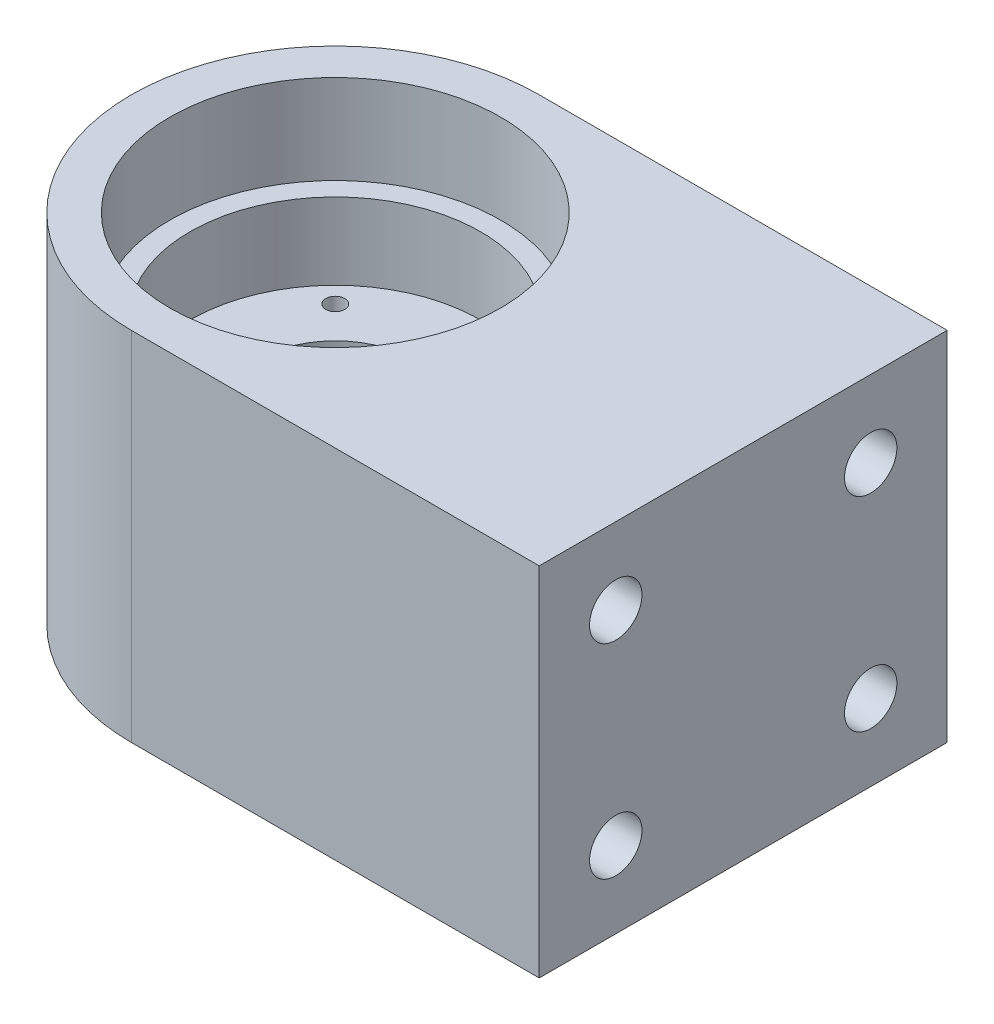
ISO-10303-21;
HEADER;
FILE_DESCRIPTION(('STEP AP214'),'2;1');
FILE_NAME('part.step','',(''),(''),'','','');
FILE_SCHEMA(('AUTOMOTIVE_DESIGN { 1 0 10303 214 1 1 1 1 }'));
ENDSEC;
DATA;
#1=APPLICATION_CONTEXT('core data for automotive mechanical design processes');
#2=APPLICATION_PROTOCOL_DEFINITION('international standard','automotive_design',2000,#1);
#3=PRODUCT_CONTEXT('',#1,'mechanical');
#4=PRODUCT('Part','Part','',(#3));
#5=PRODUCT_RELATED_PRODUCT_CATEGORY('part','',(#4));
#6=PRODUCT_DEFINITION_FORMATION('','',#4);
#7=PRODUCT_DEFINITION_CONTEXT('part definition',#1,'design');
#8=PRODUCT_DEFINITION('design','',#6,#7);
#9=PRODUCT_DEFINITION_SHAPE('','',#8);
#10=(LENGTH_UNIT() NAMED_UNIT(*) SI_UNIT(.MILLI.,.METRE.));
#11=(NAMED_UNIT(*) PLANE_ANGLE_UNIT() SI_UNIT($,.RADIAN.));
#12=(NAMED_UNIT(*) SI_UNIT($,.STERADIAN.) SOLID_ANGLE_UNIT());
#13=UNCERTAINTY_MEASURE_WITH_UNIT(LENGTH_MEASURE(1.E-05),#10,'distance_accuracy_value','');
#14=(GEOMETRIC_REPRESENTATION_CONTEXT(3) GLOBAL_UNCERTAINTY_ASSIGNED_CONTEXT((#13)) GLOBAL_UNIT_ASSIGNED_CONTEXT((#10,
#11,#12)) REPRESENTATION_CONTEXT('',''));
#15=CARTESIAN_POINT('',(0.,0.,0.));
#16=DIRECTION('',(0.,0.,1.));
#17=DIRECTION('',(1.,0.,0.));
#18=AXIS2_PLACEMENT_3D('',#15,#16,#17);
#19=CARTESIAN_POINT('',(0.,-22.225,0.));
#20=DIRECTION('',(0.,1.,0.));
#21=DIRECTION('',(0.,0.,1.));
#22=AXIS2_PLACEMENT_3D('',#19,#20,#21);
#23=CYLINDRICAL_SURFACE('',#22,9.6266);
#24=CARTESIAN_POINT('',(0.,1.5875,0.));
#25=DIRECTION('',(0.,1.,0.));
#26=DIRECTION('',(0.,0.,1.));
#27=AXIS2_PLACEMENT_3D('',#24,#25,#26);
#28=CIRCLE('',#27,9.6266);
#29=CARTESIAN_POINT('',(0.,1.5875,9.6266));
#30=VERTEX_POINT('',#29);
#31=EDGE_CURVE('E117',#30,#30,#28,.T.);
#32=ORIENTED_EDGE('',*,*,#31,.T.);
#33=EDGE_LOOP('',(#32));
#34=FACE_BOUND('',#33,.T.);
#35=CARTESIAN_POINT('',(0.,-3.3655,0.));
#36=DIRECTION('',(0.,-1.,0.));
#37=DIRECTION('',(0.,0.,-1.));
#38=AXIS2_PLACEMENT_3D('',#35,#36,#37);
#39=CIRCLE('',#38,9.6266);
#40=CARTESIAN_POINT('',(0.,-3.3655,-9.6266));
#41=VERTEX_POINT('',#40);
#42=EDGE_CURVE('E94',#41,#41,#39,.F.);
#43=ORIENTED_EDGE('',*,*,#42,.F.);
#44=EDGE_LOOP('',(#43));
#45=FACE_BOUND('',#44,.T.);
#46=ADVANCED_FACE('F35',(#34,#45),#23,.F.);
#47=CARTESIAN_POINT('',(50.8,22.225,-25.4));
#48=DIRECTION('',(0.,0.,1.));
#49=DIRECTION('',(1.,0.,0.));
#50=AXIS2_PLACEMENT_3D('',#47,#48,#49);
#51=PLANE('',#50);
#52=DIRECTION('',(-1.,0.,0.));
#53=VECTOR('',#52,1.);
#54=CARTESIAN_POINT('',(50.8,-22.225,-25.4));
#55=LINE('',#54,#53);
#56=CARTESIAN_POINT('',(50.8,-22.225,-25.4));
#57=VERTEX_POINT('',#56);
#58=CARTESIAN_POINT('',(0.,-22.225,-25.4));
#59=VERTEX_POINT('',#58);
#60=EDGE_CURVE('E82',#57,#59,#55,.T.);
#61=ORIENTED_EDGE('',*,*,#60,.T.);
#62=DIRECTION('',(0.,-1.,0.));
#63=VECTOR('',#62,1.);
#64=CARTESIAN_POINT('',(0.,22.225,-25.4));
#65=LINE('',#64,#63);
#66=CARTESIAN_POINT('',(0.,22.225,-25.4));
#67=VERTEX_POINT('',#66);
#68=EDGE_CURVE('E146',#67,#59,#65,.T.);
#69=ORIENTED_EDGE('',*,*,#68,.F.);
#70=DIRECTION('',(-1.,0.,0.));
#71=VECTOR('',#70,1.);
#72=CARTESIAN_POINT('',(50.8,22.225,-25.4));
#73=LINE('',#72,#71);
#74=CARTESIAN_POINT('',(50.8,22.225,-25.4));
#75=VERTEX_POINT('',#74);
#76=EDGE_CURVE('E76',#75,#67,#73,.T.);
#77=ORIENTED_EDGE('',*,*,#76,.F.);
#78=DIRECTION('',(0.,-1.,0.));
#79=VECTOR('',#78,1.);
#80=CARTESIAN_POINT('',(50.8,22.225,-25.4));
#81=LINE('',#80,#79);
#82=EDGE_CURVE('E73',#75,#57,#81,.T.);
#83=ORIENTED_EDGE('',*,*,#82,.T.);
#84=EDGE_LOOP('',(#61,#69,#77,#83));
#85=FACE_BOUND('',#84,.T.);
#86=ADVANCED_FACE('F37',(#85),#51,.F.);
#87=CARTESIAN_POINT('',(-25.4,22.225,25.4));
#88=DIRECTION('',(0.,0.,-1.));
#89=DIRECTION('',(-1.,0.,0.));
#90=AXIS2_PLACEMENT_3D('',#87,#88,#89);
#91=PLANE('',#90);
#92=DIRECTION('',(1.,0.,0.));
#93=VECTOR('',#92,1.);
#94=CARTESIAN_POINT('',(-25.4,22.225,25.4));
#95=LINE('',#94,#93);
#96=CARTESIAN_POINT('',(0.,22.225,25.4));
#97=VERTEX_POINT('',#96);
#98=CARTESIAN_POINT('',(50.8,22.225,25.4));
#99=VERTEX_POINT('',#98);
#100=EDGE_CURVE('E128',#97,#99,#95,.T.);
#101=ORIENTED_EDGE('',*,*,#100,.F.);
#102=DIRECTION('',(0.,-1.,0.));
#103=VECTOR('',#102,1.);
#104=CARTESIAN_POINT('',(0.,22.225,25.4));
#105=LINE('',#104,#103);
#106=CARTESIAN_POINT('',(0.,-22.225,25.4));
#107=VERTEX_POINT('',#106);
#108=EDGE_CURVE('E141',#97,#107,#105,.T.);
#109=ORIENTED_EDGE('',*,*,#108,.T.);
#110=DIRECTION('',(1.,0.,0.));
#111=VECTOR('',#110,1.);
#112=CARTESIAN_POINT('',(-25.4,-22.225,25.4));
#113=LINE('',#112,#111);
#114=CARTESIAN_POINT('',(50.8,-22.225,25.4));
#115=VERTEX_POINT('',#114);
#116=EDGE_CURVE('E77',#107,#115,#113,.T.);
#117=ORIENTED_EDGE('',*,*,#116,.T.);
#118=DIRECTION('',(0.,-1.,0.));
#119=VECTOR('',#118,1.);
#120=CARTESIAN_POINT('',(50.8,22.225,25.4));
#121=LINE('',#120,#119);
#122=EDGE_CURVE('E43',#99,#115,#121,.T.);
#123=ORIENTED_EDGE('',*,*,#122,.F.);
#124=EDGE_LOOP('',(#101,#109,#117,#123));
#125=FACE_BOUND('',#124,.T.);
#126=ADVANCED_FACE('F138',(#125),#91,.F.);
#127=CARTESIAN_POINT('',(50.8,22.225,25.4));
#128=DIRECTION('',(-1.,0.,0.));
#129=DIRECTION('',(0.,0.,1.));
#130=AXIS2_PLACEMENT_3D('',#127,#128,#129);
#131=PLANE('',#130);
#132=CARTESIAN_POINT('',(50.8,-12.7,-15.875));
#133=DIRECTION('',(1.,0.,0.));
#134=DIRECTION('',(0.,0.,-1.));
#135=AXIS2_PLACEMENT_3D('',#132,#133,#134);
#136=CIRCLE('',#135,3.2639);
#137=CARTESIAN_POINT('',(50.8,-12.7,-19.1389));
#138=VERTEX_POINT('',#137);
#139=EDGE_CURVE('E175',#138,#138,#136,.T.);
#140=ORIENTED_EDGE('',*,*,#139,.F.);
#141=EDGE_LOOP('',(#140));
#142=FACE_BOUND('',#141,.T.);
#143=CARTESIAN_POINT('',(50.8,-12.7,15.875));
#144=DIRECTION('',(1.,0.,0.));
#145=DIRECTION('',(0.,0.,-1.));
#146=AXIS2_PLACEMENT_3D('',#143,#144,#145);
#147=CIRCLE('',#146,3.2639);
#148=CARTESIAN_POINT('',(50.8,-12.7,12.6111));
#149=VERTEX_POINT('',#148);
#150=EDGE_CURVE('E179',#149,#149,#147,.T.);
#151=ORIENTED_EDGE('',*,*,#150,.F.);
#152=EDGE_LOOP('',(#151));
#153=FACE_BOUND('',#152,.T.);
#154=CARTESIAN_POINT('',(50.8,12.7,-15.875));
#155=DIRECTION('',(1.,0.,0.));
#156=DIRECTION('',(0.,0.,-1.));
#157=AXIS2_PLACEMENT_3D('',#154,#155,#156);
#158=CIRCLE('',#157,3.2639);
#159=CARTESIAN_POINT('',(50.8,12.7,-19.1389));
#160=VERTEX_POINT('',#159);
#161=EDGE_CURVE('E185',#160,#160,#158,.T.);
#162=ORIENTED_EDGE('',*,*,#161,.F.);
#163=EDGE_LOOP('',(#162));
#164=FACE_BOUND('',#163,.T.);
#165=CARTESIAN_POINT('',(50.8,12.7,15.875));
#166=DIRECTION('',(1.,0.,0.));
#167=DIRECTION('',(0.,0.,-1.));
#168=AXIS2_PLACEMENT_3D('',#165,#166,#167);
#169=CIRCLE('',#168,3.2639);
#170=CARTESIAN_POINT('',(50.8,12.7,12.6111));
#171=VERTEX_POINT('',#170);
#172=EDGE_CURVE('E112',#171,#171,#169,.T.);
#173=ORIENTED_EDGE('',*,*,#172,.F.);
#174=EDGE_LOOP('',(#173));
#175=FACE_BOUND('',#174,.T.);
#176=DIRECTION('',(0.,0.,-1.));
#177=VECTOR('',#176,1.);
#178=CARTESIAN_POINT('',(50.8,-22.225,25.4));
#179=LINE('',#178,#177);
#180=EDGE_CURVE('E70',#115,#57,#179,.T.);
#181=ORIENTED_EDGE('',*,*,#180,.T.);
#182=ORIENTED_EDGE('',*,*,#82,.F.);
#183=DIRECTION('',(0.,0.,-1.));
#184=VECTOR('',#183,1.);
#185=CARTESIAN_POINT('',(50.8,22.225,25.4));
#186=LINE('',#185,#184);
#187=EDGE_CURVE('E57',#99,#75,#186,.T.);
#188=ORIENTED_EDGE('',*,*,#187,.F.);
#189=ORIENTED_EDGE('',*,*,#122,.T.);
#190=EDGE_LOOP('',(#181,#182,#188,#189));
#191=FACE_BOUND('',#190,.T.);
#192=ADVANCED_FACE('F72',(#142,#153,#164,#175,#191),#131,.F.);
#193=CARTESIAN_POINT('',(-25.4,22.225,-25.4));
#194=DIRECTION('',(0.,1.,0.));
#195=DIRECTION('',(0.,0.,1.));
#196=AXIS2_PLACEMENT_3D('',#193,#194,#195);
#197=PLANE('',#196);
#198=CARTESIAN_POINT('',(0.,22.225,0.));
#199=DIRECTION('',(0.,1.,0.));
#200=DIRECTION('',(0.,0.,1.));
#201=AXIS2_PLACEMENT_3D('',#198,#199,#200);
#202=CIRCLE('',#201,25.4);
#203=EDGE_CURVE('E135',#67,#97,#202,.T.);
#204=ORIENTED_EDGE('',*,*,#203,.T.);
#205=ORIENTED_EDGE('',*,*,#100,.T.);
#206=ORIENTED_EDGE('',*,*,#187,.T.);
#207=ORIENTED_EDGE('',*,*,#76,.T.);
#208=EDGE_LOOP('',(#204,#205,#206,#207));
#209=FACE_BOUND('',#208,.T.);
#210=CARTESIAN_POINT('',(0.,22.225,0.));
#211=DIRECTION('',(0.,1.,0.));
#212=DIRECTION('',(0.,0.,1.));
#213=AXIS2_PLACEMENT_3D('',#210,#211,#212);
#214=CIRCLE('',#213,20.5994);
#215=CARTESIAN_POINT('',(0.,22.225,20.5994));
#216=VERTEX_POINT('',#215);
#217=EDGE_CURVE('E89',#216,#216,#214,.T.);
#218=ORIENTED_EDGE('',*,*,#217,.F.);
#219=EDGE_LOOP('',(#218));
#220=FACE_BOUND('',#219,.T.);
#221=ADVANCED_FACE('F131',(#209,#220),#197,.T.);
#222=CARTESIAN_POINT('',(-25.4,-22.225,-25.4));
#223=DIRECTION('',(0.,1.,0.));
#224=DIRECTION('',(0.,0.,1.));
#225=AXIS2_PLACEMENT_3D('',#222,#223,#224);
#226=PLANE('',#225);
#227=CARTESIAN_POINT('',(0.,-22.225,0.));
#228=DIRECTION('',(0.,-1.,0.));
#229=DIRECTION('',(0.,0.,-1.));
#230=AXIS2_PLACEMENT_3D('',#227,#228,#229);
#231=CIRCLE('',#230,19.05);
#232=CARTESIAN_POINT('',(0.,-22.225,-19.05));
#233=VERTEX_POINT('',#232);
#234=EDGE_CURVE('E96',#233,#233,#231,.T.);
#235=ORIENTED_EDGE('',*,*,#234,.F.);
#236=EDGE_LOOP('',(#235));
#237=FACE_BOUND('',#236,.T.);
#238=ORIENTED_EDGE('',*,*,#116,.F.);
#239=CARTESIAN_POINT('',(0.,-22.225,0.));
#240=DIRECTION('',(0.,1.,0.));
#241=DIRECTION('',(0.,0.,1.));
#242=AXIS2_PLACEMENT_3D('',#239,#240,#241);
#243=CIRCLE('',#242,25.4);
#244=EDGE_CURVE('E12',#107,#59,#243,.F.);
#245=ORIENTED_EDGE('',*,*,#244,.T.);
#246=ORIENTED_EDGE('',*,*,#60,.F.);
#247=ORIENTED_EDGE('',*,*,#180,.F.);
#248=EDGE_LOOP('',(#238,#245,#246,#247));
#249=FACE_BOUND('',#248,.T.);
#250=ADVANCED_FACE('F84',(#237,#249),#226,.F.);
#251=CARTESIAN_POINT('',(0.,11.1125,0.));
#252=DIRECTION('',(0.,1.,0.));
#253=DIRECTION('',(0.,0.,1.));
#254=AXIS2_PLACEMENT_3D('',#251,#252,#253);
#255=CYLINDRICAL_SURFACE('',#254,20.5994);
#256=CARTESIAN_POINT('',(0.,11.1125,0.));
#257=DIRECTION('',(0.,1.,0.));
#258=DIRECTION('',(0.,0.,1.));
#259=AXIS2_PLACEMENT_3D('',#256,#257,#258);
#260=CIRCLE('',#259,20.5994);
#261=CARTESIAN_POINT('',(0.,11.1125,20.5994));
#262=VERTEX_POINT('',#261);
#263=EDGE_CURVE('E85',#262,#262,#260,.T.);
#264=ORIENTED_EDGE('',*,*,#263,.F.);
#265=EDGE_LOOP('',(#264));
#266=FACE_BOUND('',#265,.T.);
#267=ORIENTED_EDGE('',*,*,#217,.T.);
#268=EDGE_LOOP('',(#267));
#269=FACE_BOUND('',#268,.T.);
#270=ADVANCED_FACE('F233',(#266,#269),#255,.F.);
#271=CARTESIAN_POINT('',(0.,11.1125,0.));
#272=DIRECTION('',(0.,1.,0.));
#273=DIRECTION('',(0.,0.,1.));
#274=AXIS2_PLACEMENT_3D('',#271,#272,#273);
#275=PLANE('',#274);
#276=CARTESIAN_POINT('',(0.,11.1125,0.));
#277=DIRECTION('',(0.,1.,0.));
#278=DIRECTION('',(0.,0.,1.));
#279=AXIS2_PLACEMENT_3D('',#276,#277,#278);
#280=CIRCLE('',#279,18.0975);
#281=CARTESIAN_POINT('',(0.,11.1125,18.0975));
#282=VERTEX_POINT('',#281);
#283=EDGE_CURVE('E120',#282,#282,#280,.T.);
#284=ORIENTED_EDGE('',*,*,#283,.F.);
#285=EDGE_LOOP('',(#284));
#286=FACE_BOUND('',#285,.T.);
#287=ORIENTED_EDGE('',*,*,#263,.T.);
#288=EDGE_LOOP('',(#287));
#289=FACE_BOUND('',#288,.T.);
#290=ADVANCED_FACE('F229',(#286,#289),#275,.T.);
#291=CARTESIAN_POINT('',(0.,1.5875,0.));
#292=DIRECTION('',(0.,1.,0.));
#293=DIRECTION('',(0.,0.,1.));
#294=AXIS2_PLACEMENT_3D('',#291,#292,#293);
#295=CYLINDRICAL_SURFACE('',#294,18.0975);
#296=CARTESIAN_POINT('',(0.,1.5875,0.));
#297=DIRECTION('',(0.,1.,0.));
#298=DIRECTION('',(0.,0.,1.));
#299=AXIS2_PLACEMENT_3D('',#296,#297,#298);
#300=CIRCLE('',#299,18.0975);
#301=CARTESIAN_POINT('',(0.,1.5875,18.0975));
#302=VERTEX_POINT('',#301);
#303=EDGE_CURVE('E121',#302,#302,#300,.T.);
#304=ORIENTED_EDGE('',*,*,#303,.F.);
#305=EDGE_LOOP('',(#304));
#306=FACE_BOUND('',#305,.T.);
#307=ORIENTED_EDGE('',*,*,#283,.T.);
#308=EDGE_LOOP('',(#307));
#309=FACE_BOUND('',#308,.T.);
#310=ADVANCED_FACE('F225',(#306,#309),#295,.F.);
#311=CARTESIAN_POINT('',(0.,1.5875,0.));
#312=DIRECTION('',(0.,1.,0.));
#313=DIRECTION('',(0.,0.,1.));
#314=AXIS2_PLACEMENT_3D('',#311,#312,#313);
#315=PLANE('',#314);
#316=CARTESIAN_POINT('',(-10.7763073452831,1.5875,-10.7763073452829));
#317=DIRECTION('',(0.,1.,0.));
#318=DIRECTION('',(0.,0.,1.));
#319=AXIS2_PLACEMENT_3D('',#316,#317,#318);
#320=CIRCLE('',#319,1.1811);
#321=CARTESIAN_POINT('',(-10.7763073452831,1.5875,-9.59520734528285));
#322=VERTEX_POINT('',#321);
#323=EDGE_CURVE('E151',#322,#322,#320,.T.);
#324=ORIENTED_EDGE('',*,*,#323,.F.);
#325=EDGE_LOOP('',(#324));
#326=FACE_BOUND('',#325,.T.);
#327=CARTESIAN_POINT('',(10.776307345283,1.5875,-10.776307345283));
#328=DIRECTION('',(0.,1.,0.));
#329=DIRECTION('',(0.,0.,1.));
#330=AXIS2_PLACEMENT_3D('',#327,#328,#329);
#331=CIRCLE('',#330,1.1811);
#332=CARTESIAN_POINT('',(10.776307345283,1.5875,-9.595207345283));
#333=VERTEX_POINT('',#332);
#334=EDGE_CURVE('E160',#333,#333,#331,.T.);
#335=ORIENTED_EDGE('',*,*,#334,.F.);
#336=EDGE_LOOP('',(#335));
#337=FACE_BOUND('',#336,.T.);
#338=CARTESIAN_POINT('',(10.776307345283,1.5875,10.7763073452829));
#339=DIRECTION('',(0.,1.,0.));
#340=DIRECTION('',(0.,0.,1.));
#341=AXIS2_PLACEMENT_3D('',#338,#339,#340);
#342=CIRCLE('',#341,1.1811);
#343=CARTESIAN_POINT('',(10.776307345283,1.5875,11.9574073452829));
#344=VERTEX_POINT('',#343);
#345=EDGE_CURVE('E166',#344,#344,#342,.T.);
#346=ORIENTED_EDGE('',*,*,#345,.F.);
#347=EDGE_LOOP('',(#346));
#348=FACE_BOUND('',#347,.T.);
#349=CARTESIAN_POINT('',(-10.776307345283,1.5875,10.776307345283));
#350=DIRECTION('',(0.,1.,0.));
#351=DIRECTION('',(0.,0.,1.));
#352=AXIS2_PLACEMENT_3D('',#349,#350,#351);
#353=CIRCLE('',#352,1.1811);
#354=CARTESIAN_POINT('',(-10.776307345283,1.5875,11.957407345283));
#355=VERTEX_POINT('',#354);
#356=EDGE_CURVE('E172',#355,#355,#353,.T.);
#357=ORIENTED_EDGE('',*,*,#356,.F.);
#358=EDGE_LOOP('',(#357));
#359=FACE_BOUND('',#358,.T.);
#360=ORIENTED_EDGE('',*,*,#31,.F.);
#361=EDGE_LOOP('',(#360));
#362=FACE_BOUND('',#361,.T.);
#363=ORIENTED_EDGE('',*,*,#303,.T.);
#364=EDGE_LOOP('',(#363));
#365=FACE_BOUND('',#364,.T.);
#366=ADVANCED_FACE('F222',(#326,#337,#348,#359,#362,#365),#315,.T.);
#367=CARTESIAN_POINT('',(0.,-4.7625,0.));
#368=DIRECTION('',(0.,1.,0.));
#369=DIRECTION('',(0.,0.,1.));
#370=AXIS2_PLACEMENT_3D('',#367,#368,#369);
#371=PLANE('',#370);
#372=CARTESIAN_POINT('',(-10.7763073452831,-4.7625,-10.7763073452829));
#373=DIRECTION('',(0.,-1.,0.));
#374=DIRECTION('',(1.,0.,0.));
#375=AXIS2_PLACEMENT_3D('',#372,#373,#374);
#376=CIRCLE('',#375,1.1811);
#377=CARTESIAN_POINT('',(-9.59520734528311,-4.7625,-10.7763073452829));
#378=VERTEX_POINT('',#377);
#379=EDGE_CURVE('E148',#378,#378,#376,.T.);
#380=ORIENTED_EDGE('',*,*,#379,.F.);
#381=EDGE_LOOP('',(#380));
#382=FACE_BOUND('',#381,.T.);
#383=CARTESIAN_POINT('',(10.776307345283,-4.7625,-10.776307345283));
#384=DIRECTION('',(0.,-1.,0.));
#385=DIRECTION('',(0.,0.,1.));
#386=AXIS2_PLACEMENT_3D('',#383,#384,#385);
#387=CIRCLE('',#386,1.1811);
#388=CARTESIAN_POINT('',(10.776307345283,-4.7625,-9.595207345283));
#389=VERTEX_POINT('',#388);
#390=EDGE_CURVE('E157',#389,#389,#387,.T.);
#391=ORIENTED_EDGE('',*,*,#390,.F.);
#392=EDGE_LOOP('',(#391));
#393=FACE_BOUND('',#392,.T.);
#394=CARTESIAN_POINT('',(10.776307345283,-4.7625,10.7763073452829));
#395=DIRECTION('',(0.,-1.,0.));
#396=DIRECTION('',(-1.,0.,0.));
#397=AXIS2_PLACEMENT_3D('',#394,#395,#396);
#398=CIRCLE('',#397,1.1811);
#399=CARTESIAN_POINT('',(9.59520734528304,-4.7625,10.7763073452829));
#400=VERTEX_POINT('',#399);
#401=EDGE_CURVE('E163',#400,#400,#398,.T.);
#402=ORIENTED_EDGE('',*,*,#401,.F.);
#403=EDGE_LOOP('',(#402));
#404=FACE_BOUND('',#403,.T.);
#405=CARTESIAN_POINT('',(-10.776307345283,-4.7625,10.776307345283));
#406=DIRECTION('',(0.,-1.,0.));
#407=DIRECTION('',(0.,0.,-1.));
#408=AXIS2_PLACEMENT_3D('',#405,#406,#407);
#409=CIRCLE('',#408,1.1811);
#410=CARTESIAN_POINT('',(-10.776307345283,-4.7625,9.595207345283));
#411=VERTEX_POINT('',#410);
#412=EDGE_CURVE('E169',#411,#411,#409,.T.);
#413=ORIENTED_EDGE('',*,*,#412,.F.);
#414=EDGE_LOOP('',(#413));
#415=FACE_BOUND('',#414,.T.);
#416=CARTESIAN_POINT('',(0.,-4.7625,0.));
#417=DIRECTION('',(0.,-1.,0.));
#418=DIRECTION('',(0.,0.,-1.));
#419=AXIS2_PLACEMENT_3D('',#416,#417,#418);
#420=CIRCLE('',#419,11.303);
#421=CARTESIAN_POINT('',(0.,-4.7625,-11.303));
#422=VERTEX_POINT('',#421);
#423=EDGE_CURVE('E104',#422,#422,#420,.T.);
#424=ORIENTED_EDGE('',*,*,#423,.F.);
#425=EDGE_LOOP('',(#424));
#426=FACE_BOUND('',#425,.T.);
#427=CARTESIAN_POINT('',(0.,-4.7625,0.));
#428=DIRECTION('',(0.,1.,0.));
#429=DIRECTION('',(0.,0.,1.));
#430=AXIS2_PLACEMENT_3D('',#427,#428,#429);
#431=CIRCLE('',#430,19.05);
#432=CARTESIAN_POINT('',(0.,-4.7625,19.05));
#433=VERTEX_POINT('',#432);
#434=EDGE_CURVE('E101',#433,#433,#431,.F.);
#435=ORIENTED_EDGE('',*,*,#434,.T.);
#436=EDGE_LOOP('',(#435));
#437=FACE_BOUND('',#436,.T.);
#438=ADVANCED_FACE('F220',(#382,#393,#404,#415,#426,#437),#371,.F.);
#439=CARTESIAN_POINT('',(0.,55.4690367264149,0.));
#440=DIRECTION('',(0.,-1.,0.));
#441=DIRECTION('',(0.,0.,-1.));
#442=AXIS2_PLACEMENT_3D('',#439,#440,#441);
#443=CYLINDRICAL_SURFACE('',#442,19.05);
#444=ORIENTED_EDGE('',*,*,#234,.T.);
#445=EDGE_LOOP('',(#444));
#446=FACE_BOUND('',#445,.T.);
#447=ORIENTED_EDGE('',*,*,#434,.F.);
#448=EDGE_LOOP('',(#447));
#449=FACE_BOUND('',#448,.T.);
#450=ADVANCED_FACE('F243',(#446,#449),#443,.F.);
#451=CARTESIAN_POINT('',(0.,-3.3655,0.));
#452=DIRECTION('',(0.,-1.,0.));
#453=DIRECTION('',(0.,0.,-1.));
#454=AXIS2_PLACEMENT_3D('',#451,#452,#453);
#455=PLANE('',#454);
#456=CARTESIAN_POINT('',(0.,-3.3655,0.));
#457=DIRECTION('',(0.,-1.,0.));
#458=DIRECTION('',(0.,0.,-1.));
#459=AXIS2_PLACEMENT_3D('',#456,#457,#458);
#460=CIRCLE('',#459,11.303);
#461=CARTESIAN_POINT('',(0.,-3.3655,-11.303));
#462=VERTEX_POINT('',#461);
#463=EDGE_CURVE('E97',#462,#462,#460,.T.);
#464=ORIENTED_EDGE('',*,*,#463,.T.);
#465=EDGE_LOOP('',(#464));
#466=FACE_BOUND('',#465,.T.);
#467=ORIENTED_EDGE('',*,*,#42,.T.);
#468=EDGE_LOOP('',(#467));
#469=FACE_BOUND('',#468,.T.);
#470=ADVANCED_FACE('F246',(#466,#469),#455,.T.);
#471=CARTESIAN_POINT('',(0.,-3.3655,0.));
#472=DIRECTION('',(0.,-1.,0.));
#473=DIRECTION('',(0.,0.,-1.));
#474=AXIS2_PLACEMENT_3D('',#471,#472,#473);
#475=CYLINDRICAL_SURFACE('',#474,11.303);
#476=ORIENTED_EDGE('',*,*,#463,.F.);
#477=EDGE_LOOP('',(#476));
#478=FACE_BOUND('',#477,.T.);
#479=ORIENTED_EDGE('',*,*,#423,.T.);
#480=EDGE_LOOP('',(#479));
#481=FACE_BOUND('',#480,.T.);
#482=ADVANCED_FACE('F263',(#478,#481),#475,.F.);
#483=CARTESIAN_POINT('',(31.75,12.7,15.875));
#484=DIRECTION('',(1.,0.,0.));
#485=DIRECTION('',(0.,0.,-1.));
#486=AXIS2_PLACEMENT_3D('',#483,#484,#485);
#487=CYLINDRICAL_SURFACE('',#486,3.2639);
#488=CARTESIAN_POINT('',(31.75,12.7,15.875));
#489=DIRECTION('',(1.,0.,0.));
#490=DIRECTION('',(0.,0.,-1.));
#491=AXIS2_PLACEMENT_3D('',#488,#489,#490);
#492=CIRCLE('',#491,3.2639);
#493=CARTESIAN_POINT('',(31.75,12.7,12.6111));
#494=VERTEX_POINT('',#493);
#495=EDGE_CURVE('E109',#494,#494,#492,.T.);
#496=ORIENTED_EDGE('',*,*,#495,.F.);
#497=EDGE_LOOP('',(#496));
#498=FACE_BOUND('',#497,.T.);
#499=ORIENTED_EDGE('',*,*,#172,.T.);
#500=EDGE_LOOP('',(#499));
#501=FACE_BOUND('',#500,.T.);
#502=ADVANCED_FACE('F198',(#498,#501),#487,.F.);
#503=CARTESIAN_POINT('',(31.75,12.7,15.875));
#504=DIRECTION('',(1.,0.,0.));
#505=DIRECTION('',(0.,0.,-1.));
#506=AXIS2_PLACEMENT_3D('',#503,#504,#505);
#507=PLANE('',#506);
#508=ORIENTED_EDGE('',*,*,#495,.T.);
#509=EDGE_LOOP('',(#508));
#510=FACE_BOUND('',#509,.T.);
#511=ADVANCED_FACE('F271',(#510),#507,.T.);
#512=CARTESIAN_POINT('',(31.75,12.7,-15.875));
#513=DIRECTION('',(1.,0.,0.));
#514=DIRECTION('',(0.,0.,-1.));
#515=AXIS2_PLACEMENT_3D('',#512,#513,#514);
#516=CYLINDRICAL_SURFACE('',#515,3.2639);
#517=CARTESIAN_POINT('',(31.75,12.7,-15.875));
#518=DIRECTION('',(1.,0.,0.));
#519=DIRECTION('',(0.,0.,-1.));
#520=AXIS2_PLACEMENT_3D('',#517,#518,#519);
#521=CIRCLE('',#520,3.2639);
#522=CARTESIAN_POINT('',(31.75,12.7,-19.1389));
#523=VERTEX_POINT('',#522);
#524=EDGE_CURVE('E188',#523,#523,#521,.T.);
#525=ORIENTED_EDGE('',*,*,#524,.F.);
#526=EDGE_LOOP('',(#525));
#527=FACE_BOUND('',#526,.T.);
#528=ORIENTED_EDGE('',*,*,#161,.T.);
#529=EDGE_LOOP('',(#528));
#530=FACE_BOUND('',#529,.T.);
#531=ADVANCED_FACE('F278',(#527,#530),#516,.F.);
#532=CARTESIAN_POINT('',(31.75,12.7,-15.875));
#533=DIRECTION('',(1.,0.,0.));
#534=DIRECTION('',(0.,0.,-1.));
#535=AXIS2_PLACEMENT_3D('',#532,#533,#534);
#536=PLANE('',#535);
#537=ORIENTED_EDGE('',*,*,#524,.T.);
#538=EDGE_LOOP('',(#537));
#539=FACE_BOUND('',#538,.T.);
#540=ADVANCED_FACE('F281',(#539),#536,.T.);
#541=CARTESIAN_POINT('',(31.75,-12.7,15.875));
#542=DIRECTION('',(1.,0.,0.));
#543=DIRECTION('',(0.,0.,-1.));
#544=AXIS2_PLACEMENT_3D('',#541,#542,#543);
#545=CYLINDRICAL_SURFACE('',#544,3.2639);
#546=CARTESIAN_POINT('',(31.75,-12.7,15.875));
#547=DIRECTION('',(1.,0.,0.));
#548=DIRECTION('',(0.,0.,-1.));
#549=AXIS2_PLACEMENT_3D('',#546,#547,#548);
#550=CIRCLE('',#549,3.2639);
#551=CARTESIAN_POINT('',(31.75,-12.7,12.6111));
#552=VERTEX_POINT('',#551);
#553=EDGE_CURVE('E182',#552,#552,#550,.T.);
#554=ORIENTED_EDGE('',*,*,#553,.F.);
#555=EDGE_LOOP('',(#554));
#556=FACE_BOUND('',#555,.T.);
#557=ORIENTED_EDGE('',*,*,#150,.T.);
#558=EDGE_LOOP('',(#557));
#559=FACE_BOUND('',#558,.T.);
#560=ADVANCED_FACE('F285',(#556,#559),#545,.F.);
#561=CARTESIAN_POINT('',(31.75,-12.7,15.875));
#562=DIRECTION('',(1.,0.,0.));
#563=DIRECTION('',(0.,0.,-1.));
#564=AXIS2_PLACEMENT_3D('',#561,#562,#563);
#565=PLANE('',#564);
#566=ORIENTED_EDGE('',*,*,#553,.T.);
#567=EDGE_LOOP('',(#566));
#568=FACE_BOUND('',#567,.T.);
#569=ADVANCED_FACE('F289',(#568),#565,.T.);
#570=CARTESIAN_POINT('',(31.75,-12.7,-15.875));
#571=DIRECTION('',(1.,0.,0.));
#572=DIRECTION('',(0.,0.,-1.));
#573=AXIS2_PLACEMENT_3D('',#570,#571,#572);
#574=CYLINDRICAL_SURFACE('',#573,3.2639);
#575=CARTESIAN_POINT('',(31.75,-12.7,-15.875));
#576=DIRECTION('',(1.,0.,0.));
#577=DIRECTION('',(0.,0.,-1.));
#578=AXIS2_PLACEMENT_3D('',#575,#576,#577);
#579=CIRCLE('',#578,3.2639);
#580=CARTESIAN_POINT('',(31.75,-12.7,-19.1389));
#581=VERTEX_POINT('',#580);
#582=EDGE_CURVE('E176',#581,#581,#579,.T.);
#583=ORIENTED_EDGE('',*,*,#582,.F.);
#584=EDGE_LOOP('',(#583));
#585=FACE_BOUND('',#584,.T.);
#586=ORIENTED_EDGE('',*,*,#139,.T.);
#587=EDGE_LOOP('',(#586));
#588=FACE_BOUND('',#587,.T.);
#589=ADVANCED_FACE('F293',(#585,#588),#574,.F.);
#590=CARTESIAN_POINT('',(31.75,-12.7,-15.875));
#591=DIRECTION('',(1.,0.,0.));
#592=DIRECTION('',(0.,0.,-1.));
#593=AXIS2_PLACEMENT_3D('',#590,#591,#592);
#594=PLANE('',#593);
#595=ORIENTED_EDGE('',*,*,#582,.T.);
#596=EDGE_LOOP('',(#595));
#597=FACE_BOUND('',#596,.T.);
#598=ADVANCED_FACE('F297',(#597),#594,.T.);
#599=CARTESIAN_POINT('',(-10.776307345283,22.225,10.776307345283));
#600=DIRECTION('',(0.,-1.,0.));
#601=DIRECTION('',(0.,0.,-1.));
#602=AXIS2_PLACEMENT_3D('',#599,#600,#601);
#603=CYLINDRICAL_SURFACE('',#602,1.1811);
#604=ORIENTED_EDGE('',*,*,#356,.T.);
#605=EDGE_LOOP('',(#604));
#606=FACE_BOUND('',#605,.T.);
#607=ORIENTED_EDGE('',*,*,#412,.T.);
#608=EDGE_LOOP('',(#607));
#609=FACE_BOUND('',#608,.T.);
#610=ADVANCED_FACE('F301',(#606,#609),#603,.F.);
#611=CARTESIAN_POINT('',(10.776307345283,22.225,10.7763073452829));
#612=DIRECTION('',(0.,-1.,0.));
#613=DIRECTION('',(0.,0.,-1.));
#614=AXIS2_PLACEMENT_3D('',#611,#612,#613);
#615=CYLINDRICAL_SURFACE('',#614,1.1811);
#616=ORIENTED_EDGE('',*,*,#345,.T.);
#617=EDGE_LOOP('',(#616));
#618=FACE_BOUND('',#617,.T.);
#619=ORIENTED_EDGE('',*,*,#401,.T.);
#620=EDGE_LOOP('',(#619));
#621=FACE_BOUND('',#620,.T.);
#622=ADVANCED_FACE('F305',(#618,#621),#615,.F.);
#623=CARTESIAN_POINT('',(10.776307345283,22.225,-10.776307345283));
#624=DIRECTION('',(0.,-1.,0.));
#625=DIRECTION('',(0.,0.,-1.));
#626=AXIS2_PLACEMENT_3D('',#623,#624,#625);
#627=CYLINDRICAL_SURFACE('',#626,1.1811);
#628=ORIENTED_EDGE('',*,*,#334,.T.);
#629=EDGE_LOOP('',(#628));
#630=FACE_BOUND('',#629,.T.);
#631=ORIENTED_EDGE('',*,*,#390,.T.);
#632=EDGE_LOOP('',(#631));
#633=FACE_BOUND('',#632,.T.);
#634=ADVANCED_FACE('F309',(#630,#633),#627,.F.);
#635=CARTESIAN_POINT('',(-10.7763073452831,22.225,-10.7763073452829));
#636=DIRECTION('',(0.,-1.,0.));
#637=DIRECTION('',(0.,0.,-1.));
#638=AXIS2_PLACEMENT_3D('',#635,#636,#637);
#639=CYLINDRICAL_SURFACE('',#638,1.1811);
#640=ORIENTED_EDGE('',*,*,#323,.T.);
#641=EDGE_LOOP('',(#640));
#642=FACE_BOUND('',#641,.T.);
#643=ORIENTED_EDGE('',*,*,#379,.T.);
#644=EDGE_LOOP('',(#643));
#645=FACE_BOUND('',#644,.T.);
#646=ADVANCED_FACE('F313',(#642,#645),#639,.F.);
#647=CARTESIAN_POINT('',(0.,22.225,0.));
#648=DIRECTION('',(0.,-1.,0.));
#649=DIRECTION('',(0.,0.,-1.));
#650=AXIS2_PLACEMENT_3D('',#647,#648,#649);
#651=CYLINDRICAL_SURFACE('',#650,25.4);
#652=ORIENTED_EDGE('',*,*,#244,.F.);
#653=ORIENTED_EDGE('',*,*,#108,.F.);
#654=ORIENTED_EDGE('',*,*,#203,.F.);
#655=ORIENTED_EDGE('',*,*,#68,.T.);
#656=EDGE_LOOP('',(#652,#653,#654,#655));
#657=FACE_BOUND('',#656,.T.);
#658=ADVANCED_FACE('F145',(#657),#651,.T.);
#659=CLOSED_SHELL('',(#46,#86,#126,#192,#221,#250,#270,#290,#310,#366,#438,#450,#470,#482,#502,
#511,#531,#540,#560,#569,#589,#598,#610,#622,#634,#646,#658));
#660=MANIFOLD_SOLID_BREP('B2',#659);
#661=ADVANCED_BREP_SHAPE_REPRESENTATION('',(#18,#660),#14);
#662=SHAPE_DEFINITION_REPRESENTATION(#9,#661);
ENDSEC;
END-ISO-10303-21;
